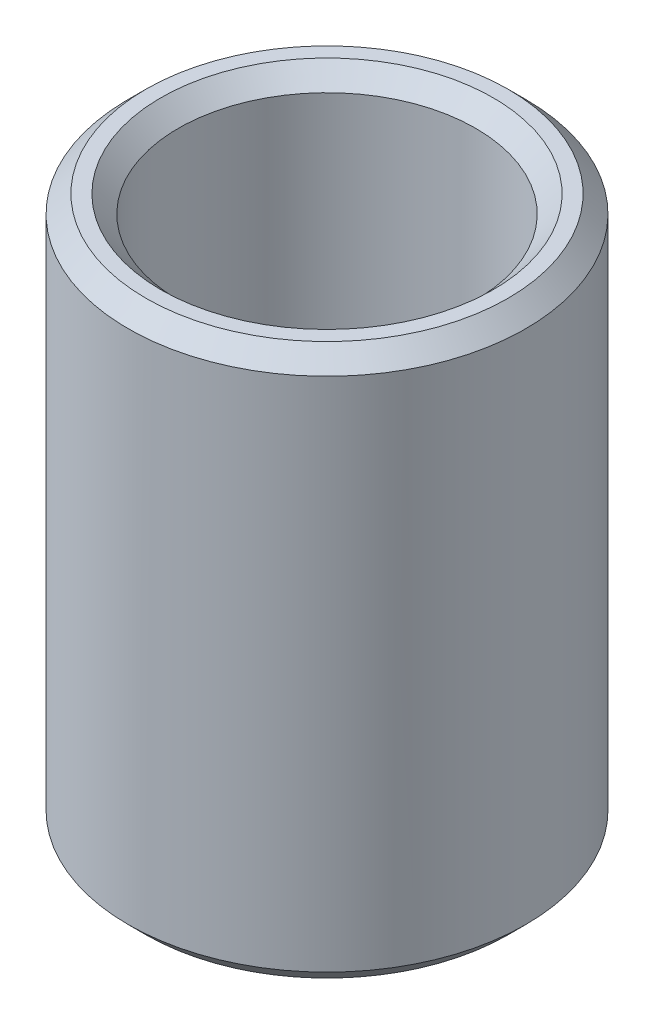
ISO-10303-21;
HEADER;
FILE_DESCRIPTION(('STEP AP214'),'2;1');
FILE_NAME('part.step','',(''),(''),'','','');
FILE_SCHEMA(('AUTOMOTIVE_DESIGN { 1 0 10303 214 1 1 1 1 }'));
ENDSEC;
DATA;
#1=APPLICATION_CONTEXT('core data for automotive mechanical design processes');
#2=APPLICATION_PROTOCOL_DEFINITION('international standard','automotive_design',2000,#1);
#3=PRODUCT_CONTEXT('',#1,'mechanical');
#4=PRODUCT('Part','Part','',(#3));
#5=PRODUCT_RELATED_PRODUCT_CATEGORY('part','',(#4));
#6=PRODUCT_DEFINITION_FORMATION('','',#4);
#7=PRODUCT_DEFINITION_CONTEXT('part definition',#1,'design');
#8=PRODUCT_DEFINITION('design','',#6,#7);
#9=PRODUCT_DEFINITION_SHAPE('','',#8);
#10=(LENGTH_UNIT() NAMED_UNIT(*) SI_UNIT(.MILLI.,.METRE.));
#11=(NAMED_UNIT(*) PLANE_ANGLE_UNIT() SI_UNIT($,.RADIAN.));
#12=(NAMED_UNIT(*) SI_UNIT($,.STERADIAN.) SOLID_ANGLE_UNIT());
#13=UNCERTAINTY_MEASURE_WITH_UNIT(LENGTH_MEASURE(1.E-05),#10,'distance_accuracy_value','');
#14=(GEOMETRIC_REPRESENTATION_CONTEXT(3) GLOBAL_UNCERTAINTY_ASSIGNED_CONTEXT((#13)) GLOBAL_UNIT_ASSIGNED_CONTEXT((#10,
#11,#12)) REPRESENTATION_CONTEXT('',''));
#15=CARTESIAN_POINT('',(0.,0.,0.));
#16=DIRECTION('',(0.,0.,1.));
#17=DIRECTION('',(1.,0.,0.));
#18=AXIS2_PLACEMENT_3D('',#15,#16,#17);
#19=CARTESIAN_POINT('',(0.,117.910318680685,0.));
#20=DIRECTION('',(0.,-1.,0.));
#21=DIRECTION('',(0.,0.,-1.));
#22=AXIS2_PLACEMENT_3D('',#19,#20,#21);
#23=CYLINDRICAL_SURFACE('',#22,42.5);
#24=CARTESIAN_POINT('',(0.,3.76513865505586,0.));
#25=DIRECTION('',(0.,1.,0.));
#26=DIRECTION('',(0.,0.,1.));
#27=AXIS2_PLACEMENT_3D('',#24,#25,#26);
#28=CIRCLE('',#27,42.5);
#29=CARTESIAN_POINT('',(0.,3.76513865505584,-42.5));
#30=VERTEX_POINT('',#29);
#31=EDGE_CURVE('E10',#30,#30,#28,.T.);
#32=CARTESIAN_POINT('',(0.,114.145180025629,0.));
#33=DIRECTION('',(0.,1.,0.));
#34=DIRECTION('',(0.,0.,1.));
#35=AXIS2_PLACEMENT_3D('',#32,#33,#34);
#36=CIRCLE('',#35,42.5);
#37=CARTESIAN_POINT('',(0.,114.145180025629,-42.5));
#38=VERTEX_POINT('',#37);
#39=EDGE_CURVE('E50',#38,#38,#36,.F.);
#40=CARTESIAN_POINT('',(0.,3.76513865505584,-42.5));
#41=CARTESIAN_POINT('',(0.,4.91493075266598,-42.5));
#42=CARTESIAN_POINT('',(0.,6.06472285027612,-42.5));
#43=CARTESIAN_POINT('',(0.,8.3643070454964,-42.5));
#44=CARTESIAN_POINT('',(0.,9.51409914310654,-42.5));
#45=CARTESIAN_POINT('',(0.,11.8136833383268,-42.5));
#46=CARTESIAN_POINT('',(0.,12.9634754359369,-42.5));
#47=CARTESIAN_POINT('',(0.,15.2630596311572,-42.5));
#48=CARTESIAN_POINT('',(0.,16.4128517287674,-42.5));
#49=CARTESIAN_POINT('',(0.,18.7124359239876,-42.5));
#50=CARTESIAN_POINT('',(0.,19.8622280215978,-42.5));
#51=CARTESIAN_POINT('',(0.,22.161812216818,-42.5));
#52=CARTESIAN_POINT('',(0.,23.3116043144282,-42.5));
#53=CARTESIAN_POINT('',(0.,25.6111885096485,-42.5));
#54=CARTESIAN_POINT('',(0.,26.7609806072586,-42.5));
#55=CARTESIAN_POINT('',(0.,29.0605648024789,-42.5));
#56=CARTESIAN_POINT('',(0.,30.210356900089,-42.5));
#57=CARTESIAN_POINT('',(0.,32.5099410953093,-42.5));
#58=CARTESIAN_POINT('',(0.,33.6597331929194,-42.5));
#59=CARTESIAN_POINT('',(0.,35.9593173881397,-42.5));
#60=CARTESIAN_POINT('',(0.,37.1091094857498,-42.5));
#61=CARTESIAN_POINT('',(0.,39.4086936809701,-42.5));
#62=CARTESIAN_POINT('',(0.,40.5584857785803,-42.5));
#63=CARTESIAN_POINT('',(0.,42.8580699738005,-42.5));
#64=CARTESIAN_POINT('',(0.,44.0078620714107,-42.5));
#65=CARTESIAN_POINT('',(0.,46.3074462666309,-42.5));
#66=CARTESIAN_POINT('',(0.,47.4572383642411,-42.5));
#67=CARTESIAN_POINT('',(0.,49.7568225594613,-42.5));
#68=CARTESIAN_POINT('',(0.,50.9066146570715,-42.5));
#69=CARTESIAN_POINT('',(0.,53.2061988522918,-42.5));
#70=CARTESIAN_POINT('',(0.,54.3559909499019,-42.5));
#71=CARTESIAN_POINT('',(0.,56.6555751451222,-42.5));
#72=CARTESIAN_POINT('',(0.,57.8053672427323,-42.5));
#73=CARTESIAN_POINT('',(0.,60.1049514379526,-42.5));
#74=CARTESIAN_POINT('',(0.,61.2547435355627,-42.5));
#75=CARTESIAN_POINT('',(0.,63.554327730783,-42.5));
#76=CARTESIAN_POINT('',(0.,64.7041198283931,-42.5));
#77=CARTESIAN_POINT('',(0.,67.0037040236134,-42.5));
#78=CARTESIAN_POINT('',(0.,68.1534961212236,-42.5));
#79=CARTESIAN_POINT('',(0.,70.4530803164438,-42.5));
#80=CARTESIAN_POINT('',(0.,71.602872414054,-42.5));
#81=CARTESIAN_POINT('',(0.,73.9024566092742,-42.5));
#82=CARTESIAN_POINT('',(0.,75.0522487068844,-42.5));
#83=CARTESIAN_POINT('',(0.,77.3518329021047,-42.5));
#84=CARTESIAN_POINT('',(0.,78.5016249997148,-42.5));
#85=CARTESIAN_POINT('',(0.,80.8012091949351,-42.5));
#86=CARTESIAN_POINT('',(0.,81.9510012925452,-42.5));
#87=CARTESIAN_POINT('',(0.,84.2505854877655,-42.5));
#88=CARTESIAN_POINT('',(0.,85.4003775853756,-42.5));
#89=CARTESIAN_POINT('',(0.,87.6999617805959,-42.5));
#90=CARTESIAN_POINT('',(0.,88.849753878206,-42.5));
#91=CARTESIAN_POINT('',(0.,91.1493380734263,-42.5));
#92=CARTESIAN_POINT('',(0.,92.2991301710364,-42.5));
#93=CARTESIAN_POINT('',(0.,94.5987143662567,-42.5));
#94=CARTESIAN_POINT('',(0.,95.7485064638668,-42.5));
#95=CARTESIAN_POINT('',(0.,98.0480906590871,-42.5));
#96=CARTESIAN_POINT('',(0.,99.1978827566973,-42.5));
#97=CARTESIAN_POINT('',(0.,101.497466951918,-42.5));
#98=CARTESIAN_POINT('',(0.,102.647259049528,-42.5));
#99=CARTESIAN_POINT('',(0.,104.946843244748,-42.5));
#100=CARTESIAN_POINT('',(0.,106.096635342358,-42.5));
#101=CARTESIAN_POINT('',(0.,108.396219537578,-42.5));
#102=CARTESIAN_POINT('',(0.,109.546011635188,-42.5));
#103=CARTESIAN_POINT('',(0.,111.845595830409,-42.5));
#104=CARTESIAN_POINT('',(0.,112.995387928019,-42.5));
#105=CARTESIAN_POINT('',(0.,114.145180025629,-42.5));
#106=B_SPLINE_CURVE_WITH_KNOTS('',3,(#40,#41,#42,#43,#44,#45,#46,#47,#48,#49,#50,#51,#52,#53,
#54,#55,#56,#57,#58,#59,#60,#61,#62,#63,#64,#65,#66,#67,#68,#69,#70,#71,#72,#73,#74,#75,#76,#77,
#78,#79,#80,#81,#82,#83,#84,#85,#86,#87,#88,#89,#90,#91,#92,#93,#94,#95,#96,#97,#98,#99,#100,
#101,#102,#103,#104,#105),.UNSPECIFIED.,.F.,.F.,(4,2,2,2,2,2,2,2,2,2,2,2,2,2,2,2,2,2,2,2,2,2,2,
2,2,2,2,2,2,2,2,2,4),(0.,3.44937629283042,6.89875258566083,10.3481288784912,13.7975051713217,
17.2468814641521,20.6962577569825,24.1456340498129,27.5950103426433,31.0443866354737,
34.4937629283041,37.9431392211345,41.392515513965,44.8418918067954,48.2912680996258,
51.7406443924562,55.1900206852866,58.639396978117,62.0887732709474,65.5381495637778,
68.9875258566082,72.4369021494387,75.8862784422691,79.3356547350995,82.7850310279299,
86.2344073207603,89.6837836135907,93.1331599064211,96.5825361992515,100.031912492082,
103.481288784912,106.930665077743,110.380041370573),.UNSPECIFIED.);
#107=EDGE_CURVE('BSEAM39',#30,#38,#106,.T.);
#108=ORIENTED_EDGE('',*,*,#31,.T.);
#109=ORIENTED_EDGE('',*,*,#39,.T.);
#110=ORIENTED_EDGE('',*,*,#107,.T.);
#111=ORIENTED_EDGE('',*,*,#107,.F.);
#112=EDGE_LOOP('',(#108,#110,#109,#111));
#113=FACE_BOUND('',#112,.T.);
#114=ADVANCED_FACE('F39',(#113),#23,.T.);
#115=CARTESIAN_POINT('',(0.,117.910318680685,0.));
#116=DIRECTION('',(0.,1.,0.));
#117=DIRECTION('',(0.,0.,1.));
#118=AXIS2_PLACEMENT_3D('',#115,#116,#117);
#119=PLANE('',#118);
#120=CARTESIAN_POINT('',(0.,117.910318680685,0.));
#121=DIRECTION('',(0.,1.,0.));
#122=DIRECTION('',(0.,0.,1.));
#123=AXIS2_PLACEMENT_3D('',#120,#121,#122);
#124=CIRCLE('',#123,35.5601233439321);
#125=CARTESIAN_POINT('',(0.,117.910318680685,35.5601233439321));
#126=VERTEX_POINT('',#125);
#127=EDGE_CURVE('E58',#126,#126,#124,.F.);
#128=ORIENTED_EDGE('',*,*,#127,.T.);
#129=EDGE_LOOP('',(#128));
#130=FACE_BOUND('',#129,.T.);
#131=CARTESIAN_POINT('',(0.,117.910318680685,0.));
#132=DIRECTION('',(0.,1.,0.));
#133=DIRECTION('',(0.,0.,1.));
#134=AXIS2_PLACEMENT_3D('',#131,#132,#133);
#135=CIRCLE('',#134,38.7348613449443);
#136=CARTESIAN_POINT('',(0.,117.910318680685,38.7348613449443));
#137=VERTEX_POINT('',#136);
#138=EDGE_CURVE('E61',#137,#137,#135,.T.);
#139=ORIENTED_EDGE('',*,*,#138,.T.);
#140=EDGE_LOOP('',(#139));
#141=FACE_BOUND('',#140,.T.);
#142=ADVANCED_FACE('F88',(#130,#141),#119,.T.);
#143=CARTESIAN_POINT('',(0.,0.,0.));
#144=DIRECTION('',(0.,1.,0.));
#145=DIRECTION('',(0.,0.,1.));
#146=AXIS2_PLACEMENT_3D('',#143,#144,#145);
#147=PLANE('',#146);
#148=CARTESIAN_POINT('',(0.,0.,0.));
#149=DIRECTION('',(0.,1.,0.));
#150=DIRECTION('',(0.,0.,1.));
#151=AXIS2_PLACEMENT_3D('',#148,#149,#150);
#152=CIRCLE('',#151,35.560123343932);
#153=CARTESIAN_POINT('',(0.,0.,35.560123343932));
#154=VERTEX_POINT('',#153);
#155=EDGE_CURVE('E51',#154,#154,#152,.T.);
#156=ORIENTED_EDGE('',*,*,#155,.T.);
#157=EDGE_LOOP('',(#156));
#158=FACE_BOUND('',#157,.T.);
#159=CARTESIAN_POINT('',(0.,0.,0.));
#160=DIRECTION('',(0.,1.,0.));
#161=DIRECTION('',(0.,0.,1.));
#162=AXIS2_PLACEMENT_3D('',#159,#160,#161);
#163=CIRCLE('',#162,38.7348613449441);
#164=CARTESIAN_POINT('',(0.,0.,38.7348613449441));
#165=VERTEX_POINT('',#164);
#166=EDGE_CURVE('E54',#165,#165,#163,.F.);
#167=ORIENTED_EDGE('',*,*,#166,.T.);
#168=EDGE_LOOP('',(#167));
#169=FACE_BOUND('',#168,.T.);
#170=ADVANCED_FACE('F83',(#158,#169),#147,.F.);
#171=CARTESIAN_POINT('',(0.,117.910318680685,0.));
#172=DIRECTION('',(0.,-1.,0.));
#173=DIRECTION('',(0.,0.,-1.));
#174=AXIS2_PLACEMENT_3D('',#171,#172,#173);
#175=CYLINDRICAL_SURFACE('',#174,31.7949846888762);
#176=CARTESIAN_POINT('',(0.,114.145180025629,0.));
#177=DIRECTION('',(0.,1.,0.));
#178=DIRECTION('',(0.,0.,1.));
#179=AXIS2_PLACEMENT_3D('',#176,#177,#178);
#180=CIRCLE('',#179,31.7949846888762);
#181=CARTESIAN_POINT('',(0.,114.145180025629,-31.7949846888762));
#182=VERTEX_POINT('',#181);
#183=EDGE_CURVE('E67',#182,#182,#180,.T.);
#184=CARTESIAN_POINT('',(0.,3.76513865505577,0.));
#185=DIRECTION('',(0.,1.,0.));
#186=DIRECTION('',(0.,0.,1.));
#187=AXIS2_PLACEMENT_3D('',#184,#185,#186);
#188=CIRCLE('',#187,31.7949846888762);
#189=CARTESIAN_POINT('',(0.,3.76513865505576,-31.7949846888762));
#190=VERTEX_POINT('',#189);
#191=EDGE_CURVE('E69',#190,#190,#188,.F.);
#192=CARTESIAN_POINT('',(0.,114.145180025629,-31.7949846888762));
#193=CARTESIAN_POINT('',(0.,112.995387928019,-31.7949846888762));
#194=CARTESIAN_POINT('',(0.,111.845595830409,-31.7949846888762));
#195=CARTESIAN_POINT('',(0.,109.546011635188,-31.7949846888762));
#196=CARTESIAN_POINT('',(0.,108.396219537578,-31.7949846888762));
#197=CARTESIAN_POINT('',(0.,106.096635342358,-31.7949846888762));
#198=CARTESIAN_POINT('',(0.,104.946843244748,-31.7949846888762));
#199=CARTESIAN_POINT('',(0.,102.647259049528,-31.7949846888762));
#200=CARTESIAN_POINT('',(0.,101.497466951917,-31.7949846888762));
#201=CARTESIAN_POINT('',(0.,99.1978827566972,-31.7949846888762));
#202=CARTESIAN_POINT('',(0.,98.048090659087,-31.7949846888762));
#203=CARTESIAN_POINT('',(0.,95.7485064638667,-31.7949846888762));
#204=CARTESIAN_POINT('',(0.,94.5987143662566,-31.7949846888762));
#205=CARTESIAN_POINT('',(0.,92.2991301710363,-31.7949846888762));
#206=CARTESIAN_POINT('',(0.,91.1493380734262,-31.7949846888762));
#207=CARTESIAN_POINT('',(0.,88.8497538782059,-31.7949846888762));
#208=CARTESIAN_POINT('',(0.,87.6999617805958,-31.7949846888762));
#209=CARTESIAN_POINT('',(0.,85.4003775853755,-31.7949846888762));
#210=CARTESIAN_POINT('',(0.,84.2505854877654,-31.7949846888762));
#211=CARTESIAN_POINT('',(0.,81.9510012925451,-31.7949846888762));
#212=CARTESIAN_POINT('',(0.,80.801209194935,-31.7949846888762));
#213=CARTESIAN_POINT('',(0.,78.5016249997147,-31.7949846888762));
#214=CARTESIAN_POINT('',(0.,77.3518329021045,-31.7949846888762));
#215=CARTESIAN_POINT('',(0.,75.0522487068843,-31.7949846888762));
#216=CARTESIAN_POINT('',(0.,73.9024566092742,-31.7949846888762));
#217=CARTESIAN_POINT('',(0.,71.6028724140539,-31.7949846888762));
#218=CARTESIAN_POINT('',(0.,70.4530803164437,-31.7949846888762));
#219=CARTESIAN_POINT('',(0.,68.1534961212235,-31.7949846888762));
#220=CARTESIAN_POINT('',(0.,67.0037040236133,-31.7949846888762));
#221=CARTESIAN_POINT('',(0.,64.704119828393,-31.7949846888762));
#222=CARTESIAN_POINT('',(0.,63.5543277307829,-31.7949846888762));
#223=CARTESIAN_POINT('',(0.,61.2547435355626,-31.7949846888762));
#224=CARTESIAN_POINT('',(0.,60.1049514379525,-31.7949846888762));
#225=CARTESIAN_POINT('',(0.,57.8053672427322,-31.7949846888762));
#226=CARTESIAN_POINT('',(0.,56.6555751451221,-31.7949846888762));
#227=CARTESIAN_POINT('',(0.,54.3559909499018,-31.7949846888762));
#228=CARTESIAN_POINT('',(0.,53.2061988522917,-31.7949846888762));
#229=CARTESIAN_POINT('',(0.,50.9066146570714,-31.7949846888762));
#230=CARTESIAN_POINT('',(0.,49.7568225594613,-31.7949846888762));
#231=CARTESIAN_POINT('',(0.,47.457238364241,-31.7949846888762));
#232=CARTESIAN_POINT('',(0.,46.3074462666308,-31.7949846888762));
#233=CARTESIAN_POINT('',(0.,44.0078620714106,-31.7949846888762));
#234=CARTESIAN_POINT('',(0.,42.8580699738004,-31.7949846888762));
#235=CARTESIAN_POINT('',(0.,40.5584857785802,-31.7949846888762));
#236=CARTESIAN_POINT('',(0.,39.40869368097,-31.7949846888762));
#237=CARTESIAN_POINT('',(0.,37.1091094857497,-31.7949846888762));
#238=CARTESIAN_POINT('',(0.,35.9593173881396,-31.7949846888762));
#239=CARTESIAN_POINT('',(0.,33.6597331929193,-31.7949846888762));
#240=CARTESIAN_POINT('',(0.,32.5099410953092,-31.7949846888762));
#241=CARTESIAN_POINT('',(0.,30.2103569000889,-31.7949846888762));
#242=CARTESIAN_POINT('',(0.,29.0605648024788,-31.7949846888762));
#243=CARTESIAN_POINT('',(0.,26.7609806072585,-31.7949846888762));
#244=CARTESIAN_POINT('',(0.,25.6111885096484,-31.7949846888762));
#245=CARTESIAN_POINT('',(0.,23.3116043144281,-31.7949846888762));
#246=CARTESIAN_POINT('',(0.,22.161812216818,-31.7949846888762));
#247=CARTESIAN_POINT('',(0.,19.8622280215977,-31.7949846888762));
#248=CARTESIAN_POINT('',(0.,18.7124359239875,-31.7949846888762));
#249=CARTESIAN_POINT('',(0.,16.4128517287673,-31.7949846888762));
#250=CARTESIAN_POINT('',(0.,15.2630596311571,-31.7949846888762));
#251=CARTESIAN_POINT('',(0.,12.9634754359369,-31.7949846888762));
#252=CARTESIAN_POINT('',(0.,11.8136833383267,-31.7949846888762));
#253=CARTESIAN_POINT('',(0.,9.51409914310645,-31.7949846888762));
#254=CARTESIAN_POINT('',(0.,8.36430704549631,-31.7949846888762));
#255=CARTESIAN_POINT('',(0.,6.06472285027604,-31.7949846888762));
#256=CARTESIAN_POINT('',(0.,4.9149307526659,-31.7949846888762));
#257=CARTESIAN_POINT('',(0.,3.76513865505576,-31.7949846888762));
#258=B_SPLINE_CURVE_WITH_KNOTS('',3,(#192,#193,#194,#195,#196,#197,#198,#199,#200,#201,#202,
#203,#204,#205,#206,#207,#208,#209,#210,#211,#212,#213,#214,#215,#216,#217,#218,#219,#220,#221,
#222,#223,#224,#225,#226,#227,#228,#229,#230,#231,#232,#233,#234,#235,#236,#237,#238,#239,#240,
#241,#242,#243,#244,#245,#246,#247,#248,#249,#250,#251,#252,#253,#254,#255,#256,#257),
.UNSPECIFIED.,.F.,.F.,(4,2,2,2,2,2,2,2,2,2,2,2,2,2,2,2,2,2,2,2,2,2,2,2,2,2,2,2,2,2,2,2,4),(0.,
3.4493762928304,6.89875258566082,10.3481288784912,13.7975051713216,17.2468814641521,
20.6962577569825,24.1456340498129,27.5950103426433,31.0443866354737,34.4937629283041,
37.9431392211345,41.3925155139649,44.8418918067953,48.2912680996258,51.7406443924562,
55.1900206852866,58.639396978117,62.0887732709474,65.5381495637778,68.9875258566082,
72.4369021494386,75.8862784422691,79.3356547350995,82.7850310279299,86.2344073207603,
89.6837836135907,93.1331599064211,96.5825361992515,100.031912492082,103.481288784912,
106.930665077743,110.380041370573),.UNSPECIFIED.);
#259=EDGE_CURVE('BSEAM71',#182,#190,#258,.T.);
#260=ORIENTED_EDGE('',*,*,#183,.T.);
#261=ORIENTED_EDGE('',*,*,#191,.T.);
#262=ORIENTED_EDGE('',*,*,#259,.T.);
#263=ORIENTED_EDGE('',*,*,#259,.F.);
#264=EDGE_LOOP('',(#260,#262,#261,#263));
#265=FACE_BOUND('',#264,.T.);
#266=ADVANCED_FACE('F71',(#265),#175,.F.);
#267=CARTESIAN_POINT('',(0.,114.145180025629,0.));
#268=DIRECTION('',(0.,1.,0.));
#269=DIRECTION('',(0.,0.,1.));
#270=AXIS2_PLACEMENT_3D('',#267,#268,#269);
#271=CONICAL_SURFACE('',#270,31.7949846888762,0.785398163397455);
#272=ORIENTED_EDGE('',*,*,#127,.F.);
#273=EDGE_LOOP('',(#272));
#274=FACE_BOUND('',#273,.T.);
#275=ORIENTED_EDGE('',*,*,#183,.F.);
#276=EDGE_LOOP('',(#275));
#277=FACE_BOUND('',#276,.T.);
#278=ADVANCED_FACE('F77',(#274,#277),#271,.F.);
#279=CARTESIAN_POINT('',(0.,0.,0.));
#280=DIRECTION('',(0.,-1.,0.));
#281=DIRECTION('',(0.,0.,-1.));
#282=AXIS2_PLACEMENT_3D('',#279,#280,#281);
#283=CONICAL_SURFACE('',#282,35.560123343932,0.785398163397447);
#284=ORIENTED_EDGE('',*,*,#191,.F.);
#285=EDGE_LOOP('',(#284));
#286=FACE_BOUND('',#285,.T.);
#287=ORIENTED_EDGE('',*,*,#155,.F.);
#288=EDGE_LOOP('',(#287));
#289=FACE_BOUND('',#288,.T.);
#290=ADVANCED_FACE('F73',(#286,#289),#283,.F.);
#291=CARTESIAN_POINT('',(0.,3.76513865505586,0.));
#292=DIRECTION('',(0.,1.,0.));
#293=DIRECTION('',(0.,0.,1.));
#294=AXIS2_PLACEMENT_3D('',#291,#292,#293);
#295=CONICAL_SURFACE('',#294,42.5,0.785398163397453);
#296=ORIENTED_EDGE('',*,*,#166,.F.);
#297=EDGE_LOOP('',(#296));
#298=FACE_BOUND('',#297,.T.);
#299=ORIENTED_EDGE('',*,*,#31,.F.);
#300=EDGE_LOOP('',(#299));
#301=FACE_BOUND('',#300,.T.);
#302=ADVANCED_FACE('F76',(#298,#301),#295,.T.);
#303=CARTESIAN_POINT('',(0.,117.910318680685,0.));
#304=DIRECTION('',(0.,-1.,0.));
#305=DIRECTION('',(0.,0.,-1.));
#306=AXIS2_PLACEMENT_3D('',#303,#304,#305);
#307=CONICAL_SURFACE('',#306,38.7348613449443,0.785398163397444);
#308=ORIENTED_EDGE('',*,*,#39,.F.);
#309=EDGE_LOOP('',(#308));
#310=FACE_BOUND('',#309,.T.);
#311=ORIENTED_EDGE('',*,*,#138,.F.);
#312=EDGE_LOOP('',(#311));
#313=FACE_BOUND('',#312,.T.);
#314=ADVANCED_FACE('F45',(#310,#313),#307,.T.);
#315=CLOSED_SHELL('',(#114,#142,#170,#266,#278,#290,#302,#314));
#316=MANIFOLD_SOLID_BREP('B2',#315);
#317=ADVANCED_BREP_SHAPE_REPRESENTATION('',(#18,#316),#14);
#318=SHAPE_DEFINITION_REPRESENTATION(#9,#317);
ENDSEC;
END-ISO-10303-21;
